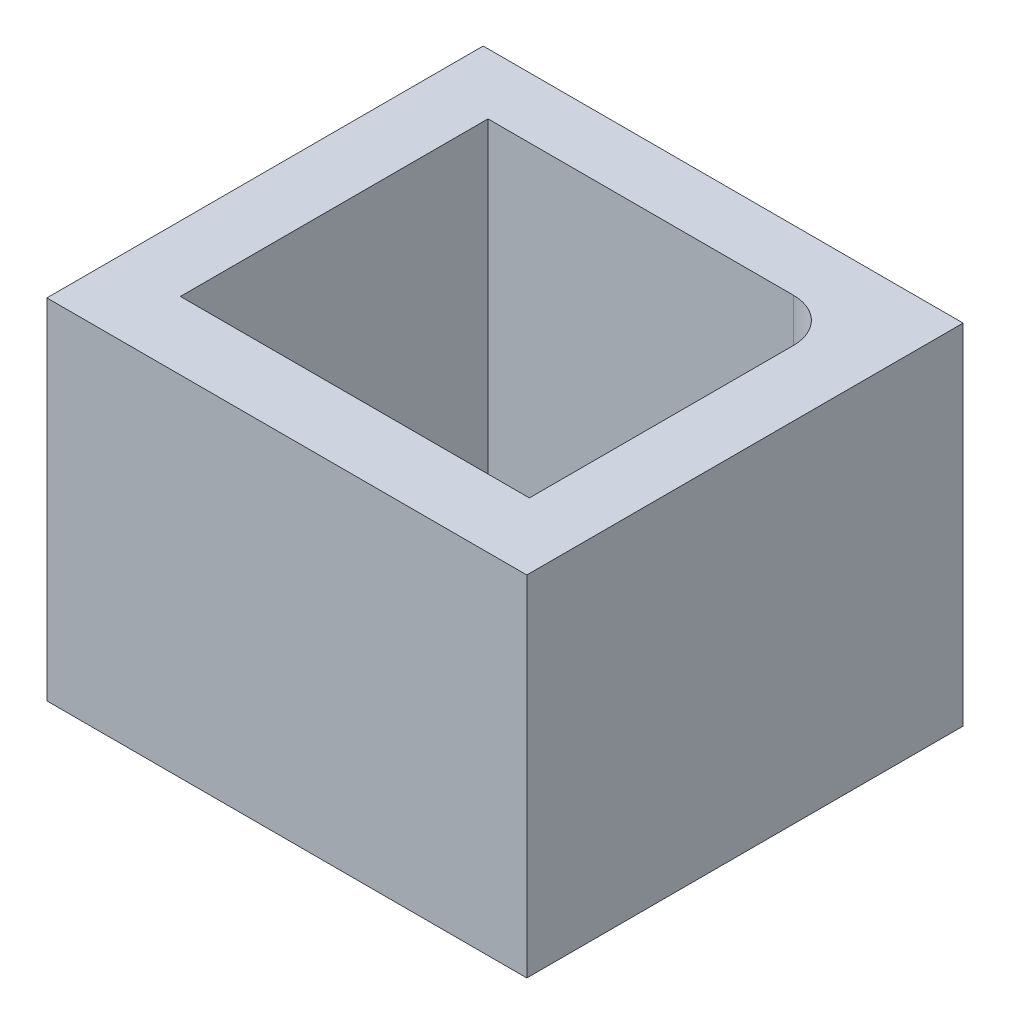
ISO-10303-21;
HEADER;
FILE_DESCRIPTION(('STEP AP214'),'2;1');
FILE_NAME('part.step','',(''),(''),'','','');
FILE_SCHEMA(('AUTOMOTIVE_DESIGN { 1 0 10303 214 1 1 1 1 }'));
ENDSEC;
DATA;
#1=APPLICATION_CONTEXT('core data for automotive mechanical design processes');
#2=APPLICATION_PROTOCOL_DEFINITION('international standard','automotive_design',2000,#1);
#3=PRODUCT_CONTEXT('',#1,'mechanical');
#4=PRODUCT('Part','Part','',(#3));
#5=PRODUCT_RELATED_PRODUCT_CATEGORY('part','',(#4));
#6=PRODUCT_DEFINITION_FORMATION('','',#4);
#7=PRODUCT_DEFINITION_CONTEXT('part definition',#1,'design');
#8=PRODUCT_DEFINITION('design','',#6,#7);
#9=PRODUCT_DEFINITION_SHAPE('','',#8);
#10=(LENGTH_UNIT() NAMED_UNIT(*) SI_UNIT(.MILLI.,.METRE.));
#11=(NAMED_UNIT(*) PLANE_ANGLE_UNIT() SI_UNIT($,.RADIAN.));
#12=(NAMED_UNIT(*) SI_UNIT($,.STERADIAN.) SOLID_ANGLE_UNIT());
#13=UNCERTAINTY_MEASURE_WITH_UNIT(LENGTH_MEASURE(1.E-05),#10,'distance_accuracy_value','');
#14=(GEOMETRIC_REPRESENTATION_CONTEXT(3) GLOBAL_UNCERTAINTY_ASSIGNED_CONTEXT((#13)) GLOBAL_UNIT_ASSIGNED_CONTEXT((#10,
#11,#12)) REPRESENTATION_CONTEXT('',''));
#15=CARTESIAN_POINT('',(0.,0.,0.));
#16=DIRECTION('',(0.,0.,1.));
#17=DIRECTION('',(1.,0.,0.));
#18=AXIS2_PLACEMENT_3D('',#15,#16,#17);
#19=CARTESIAN_POINT('',(0.,30.,0.));
#20=DIRECTION('',(0.,-1.,0.));
#21=DIRECTION('',(0.,0.,-1.));
#22=AXIS2_PLACEMENT_3D('',#19,#20,#21);
#23=PLANE('',#22);
#24=CARTESIAN_POINT('',(15.,30.,-15.));
#25=DIRECTION('',(0.,1.,0.));
#26=DIRECTION('',(0.,0.,1.));
#27=AXIS2_PLACEMENT_3D('',#24,#25,#26);
#28=CIRCLE('',#27,5.);
#29=CARTESIAN_POINT('',(20.,30.,-15.));
#30=VERTEX_POINT('',#29);
#31=CARTESIAN_POINT('',(15.,30.,-20.));
#32=VERTEX_POINT('',#31);
#33=EDGE_CURVE('E75',#30,#32,#28,.T.);
#34=ORIENTED_EDGE('',*,*,#33,.T.);
#35=DIRECTION('',(-1.,0.,0.));
#36=VECTOR('',#35,1.);
#37=CARTESIAN_POINT('',(15.,30.,-20.));
#38=LINE('',#37,#36);
#39=CARTESIAN_POINT('',(-19.9936005393496,30.,-20.));
#40=VERTEX_POINT('',#39);
#41=EDGE_CURVE('E186',#32,#40,#38,.T.);
#42=ORIENTED_EDGE('',*,*,#41,.T.);
#43=DIRECTION('',(0.,0.,1.));
#44=VECTOR('',#43,1.);
#45=CARTESIAN_POINT('',(-19.9936005393496,30.,-20.));
#46=LINE('',#45,#44);
#47=CARTESIAN_POINT('',(-19.9936005393496,30.,15.25));
#48=VERTEX_POINT('',#47);
#49=EDGE_CURVE('E190',#40,#48,#46,.T.);
#50=ORIENTED_EDGE('',*,*,#49,.T.);
#51=DIRECTION('',(1.,0.,0.));
#52=VECTOR('',#51,1.);
#53=CARTESIAN_POINT('',(-19.9936005393496,30.,15.25));
#54=LINE('',#53,#52);
#55=CARTESIAN_POINT('',(20.,30.,15.25));
#56=VERTEX_POINT('',#55);
#57=EDGE_CURVE('E194',#48,#56,#54,.T.);
#58=ORIENTED_EDGE('',*,*,#57,.T.);
#59=DIRECTION('',(0.,0.,-1.));
#60=VECTOR('',#59,1.);
#61=CARTESIAN_POINT('',(20.,30.,15.25));
#62=LINE('',#61,#60);
#63=EDGE_CURVE('E142',#56,#30,#62,.T.);
#64=ORIENTED_EDGE('',*,*,#63,.T.);
#65=EDGE_LOOP('',(#34,#42,#50,#58,#64));
#66=FACE_BOUND('',#65,.T.);
#67=DIRECTION('',(1.,0.,0.));
#68=VECTOR('',#67,1.);
#69=CARTESIAN_POINT('',(-27.5,30.,23.0435212218331));
#70=LINE('',#69,#68);
#71=CARTESIAN_POINT('',(-27.5,30.,23.0435212218331));
#72=VERTEX_POINT('',#71);
#73=CARTESIAN_POINT('',(27.5,30.,23.0435212218331));
#74=VERTEX_POINT('',#73);
#75=EDGE_CURVE('E83',#72,#74,#70,.T.);
#76=ORIENTED_EDGE('',*,*,#75,.F.);
#77=DIRECTION('',(0.,0.,1.));
#78=VECTOR('',#77,1.);
#79=CARTESIAN_POINT('',(-27.5,30.,23.0435212218331));
#80=LINE('',#79,#78);
#81=CARTESIAN_POINT('',(-27.5,30.,-26.9564787781669));
#82=VERTEX_POINT('',#81);
#83=EDGE_CURVE('E217',#82,#72,#80,.T.);
#84=ORIENTED_EDGE('',*,*,#83,.F.);
#85=DIRECTION('',(-1.,0.,0.));
#86=VECTOR('',#85,1.);
#87=CARTESIAN_POINT('',(-27.5,30.,-26.9564787781669));
#88=LINE('',#87,#86);
#89=CARTESIAN_POINT('',(27.5,30.,-26.9564787781669));
#90=VERTEX_POINT('',#89);
#91=EDGE_CURVE('E214',#90,#82,#88,.T.);
#92=ORIENTED_EDGE('',*,*,#91,.F.);
#93=DIRECTION('',(0.,0.,-1.));
#94=VECTOR('',#93,1.);
#95=CARTESIAN_POINT('',(27.5,30.,23.0435212218331));
#96=LINE('',#95,#94);
#97=EDGE_CURVE('E211',#74,#90,#96,.T.);
#98=ORIENTED_EDGE('',*,*,#97,.F.);
#99=EDGE_LOOP('',(#76,#84,#92,#98));
#100=FACE_BOUND('',#99,.T.);
#101=ADVANCED_FACE('F59',(#66,#100),#23,.T.);
#102=CARTESIAN_POINT('',(27.5,35.,23.0435212218331));
#103=DIRECTION('',(-1.,0.,0.));
#104=DIRECTION('',(0.,0.,1.));
#105=AXIS2_PLACEMENT_3D('',#102,#103,#104);
#106=PLANE('',#105);
#107=ORIENTED_EDGE('',*,*,#97,.T.);
#108=DIRECTION('',(0.,-1.,0.));
#109=VECTOR('',#108,1.);
#110=CARTESIAN_POINT('',(27.5,35.,-26.9564787781669));
#111=LINE('',#110,#109);
#112=CARTESIAN_POINT('',(27.5,70.,-26.9564787781669));
#113=VERTEX_POINT('',#112);
#114=EDGE_CURVE('E12',#113,#90,#111,.T.);
#115=ORIENTED_EDGE('',*,*,#114,.F.);
#116=DIRECTION('',(0.,0.,1.));
#117=VECTOR('',#116,1.);
#118=CARTESIAN_POINT('',(27.5,70.,23.0435212218331));
#119=LINE('',#118,#117);
#120=CARTESIAN_POINT('',(27.5,70.,23.0435212218331));
#121=VERTEX_POINT('',#120);
#122=EDGE_CURVE('E176',#113,#121,#119,.T.);
#123=ORIENTED_EDGE('',*,*,#122,.T.);
#124=DIRECTION('',(0.,-1.,0.));
#125=VECTOR('',#124,1.);
#126=CARTESIAN_POINT('',(27.5,35.,23.0435212218331));
#127=LINE('',#126,#125);
#128=EDGE_CURVE('E222',#121,#74,#127,.T.);
#129=ORIENTED_EDGE('',*,*,#128,.T.);
#130=EDGE_LOOP('',(#107,#115,#123,#129));
#131=FACE_BOUND('',#130,.T.);
#132=ADVANCED_FACE('F61',(#131),#106,.F.);
#133=CARTESIAN_POINT('',(-27.5,35.,-26.9564787781669));
#134=DIRECTION('',(0.,0.,1.));
#135=DIRECTION('',(1.,0.,0.));
#136=AXIS2_PLACEMENT_3D('',#133,#134,#135);
#137=PLANE('',#136);
#138=ORIENTED_EDGE('',*,*,#91,.T.);
#139=DIRECTION('',(0.,-1.,0.));
#140=VECTOR('',#139,1.);
#141=CARTESIAN_POINT('',(-27.5,35.,-26.9564787781669));
#142=LINE('',#141,#140);
#143=CARTESIAN_POINT('',(-27.5,70.,-26.9564787781669));
#144=VERTEX_POINT('',#143);
#145=EDGE_CURVE('E68',#144,#82,#142,.T.);
#146=ORIENTED_EDGE('',*,*,#145,.F.);
#147=DIRECTION('',(1.,0.,0.));
#148=VECTOR('',#147,1.);
#149=CARTESIAN_POINT('',(-27.5,70.,-26.9564787781669));
#150=LINE('',#149,#148);
#151=EDGE_CURVE('E172',#144,#113,#150,.T.);
#152=ORIENTED_EDGE('',*,*,#151,.T.);
#153=ORIENTED_EDGE('',*,*,#114,.T.);
#154=EDGE_LOOP('',(#138,#146,#152,#153));
#155=FACE_BOUND('',#154,.T.);
#156=ADVANCED_FACE('F242',(#155),#137,.F.);
#157=CARTESIAN_POINT('',(-27.5,35.,23.0435212218331));
#158=DIRECTION('',(1.,0.,0.));
#159=DIRECTION('',(0.,0.,-1.));
#160=AXIS2_PLACEMENT_3D('',#157,#158,#159);
#161=PLANE('',#160);
#162=ORIENTED_EDGE('',*,*,#83,.T.);
#163=DIRECTION('',(0.,-1.,0.));
#164=VECTOR('',#163,1.);
#165=CARTESIAN_POINT('',(-27.5,35.,23.0435212218331));
#166=LINE('',#165,#164);
#167=CARTESIAN_POINT('',(-27.5,70.,23.0435212218331));
#168=VERTEX_POINT('',#167);
#169=EDGE_CURVE('E225',#168,#72,#166,.T.);
#170=ORIENTED_EDGE('',*,*,#169,.F.);
#171=DIRECTION('',(0.,0.,-1.));
#172=VECTOR('',#171,1.);
#173=CARTESIAN_POINT('',(-27.5,70.,23.0435212218331));
#174=LINE('',#173,#172);
#175=EDGE_CURVE('E168',#168,#144,#174,.T.);
#176=ORIENTED_EDGE('',*,*,#175,.T.);
#177=ORIENTED_EDGE('',*,*,#145,.T.);
#178=EDGE_LOOP('',(#162,#170,#176,#177));
#179=FACE_BOUND('',#178,.T.);
#180=ADVANCED_FACE('F231',(#179),#161,.F.);
#181=CARTESIAN_POINT('',(-27.5,35.,23.0435212218331));
#182=DIRECTION('',(0.,0.,-1.));
#183=DIRECTION('',(-1.,0.,0.));
#184=AXIS2_PLACEMENT_3D('',#181,#182,#183);
#185=PLANE('',#184);
#186=ORIENTED_EDGE('',*,*,#75,.T.);
#187=ORIENTED_EDGE('',*,*,#128,.F.);
#188=DIRECTION('',(-1.,0.,0.));
#189=VECTOR('',#188,1.);
#190=CARTESIAN_POINT('',(-27.5,70.,23.0435212218331));
#191=LINE('',#190,#189);
#192=EDGE_CURVE('E180',#121,#168,#191,.T.);
#193=ORIENTED_EDGE('',*,*,#192,.T.);
#194=ORIENTED_EDGE('',*,*,#169,.T.);
#195=EDGE_LOOP('',(#186,#187,#193,#194));
#196=FACE_BOUND('',#195,.T.);
#197=ADVANCED_FACE('F241',(#196),#185,.F.);
#198=CARTESIAN_POINT('',(15.,35.,-15.));
#199=DIRECTION('',(0.,-1.,0.));
#200=DIRECTION('',(0.,0.,-1.));
#201=AXIS2_PLACEMENT_3D('',#198,#199,#200);
#202=CYLINDRICAL_SURFACE('',#201,5.);
#203=ORIENTED_EDGE('',*,*,#33,.F.);
#204=DIRECTION('',(0.,-1.,0.));
#205=VECTOR('',#204,1.);
#206=CARTESIAN_POINT('',(20.,35.,-15.));
#207=LINE('',#206,#205);
#208=CARTESIAN_POINT('',(20.,70.,-15.));
#209=VERTEX_POINT('',#208);
#210=EDGE_CURVE('E131',#209,#30,#207,.T.);
#211=ORIENTED_EDGE('',*,*,#210,.F.);
#212=CARTESIAN_POINT('',(15.,70.,-15.));
#213=DIRECTION('',(0.,-1.,0.));
#214=DIRECTION('',(0.,0.,-1.));
#215=AXIS2_PLACEMENT_3D('',#212,#213,#214);
#216=CIRCLE('',#215,5.);
#217=CARTESIAN_POINT('',(15.,70.,-20.));
#218=VERTEX_POINT('',#217);
#219=EDGE_CURVE('E135',#218,#209,#216,.T.);
#220=ORIENTED_EDGE('',*,*,#219,.F.);
#221=DIRECTION('',(0.,-1.,0.));
#222=VECTOR('',#221,1.);
#223=CARTESIAN_POINT('',(15.,35.,-20.));
#224=LINE('',#223,#222);
#225=EDGE_CURVE('E208',#218,#32,#224,.T.);
#226=ORIENTED_EDGE('',*,*,#225,.T.);
#227=EDGE_LOOP('',(#203,#211,#220,#226));
#228=FACE_BOUND('',#227,.T.);
#229=ADVANCED_FACE('F133',(#228),#202,.F.);
#230=CARTESIAN_POINT('',(15.,35.,-20.));
#231=DIRECTION('',(0.,0.,1.));
#232=DIRECTION('',(1.,0.,0.));
#233=AXIS2_PLACEMENT_3D('',#230,#231,#232);
#234=PLANE('',#233);
#235=ORIENTED_EDGE('',*,*,#41,.F.);
#236=ORIENTED_EDGE('',*,*,#225,.F.);
#237=DIRECTION('',(1.,0.,0.));
#238=VECTOR('',#237,1.);
#239=CARTESIAN_POINT('',(-19.9936005393496,70.,-20.));
#240=LINE('',#239,#238);
#241=CARTESIAN_POINT('',(-19.9936005393496,70.,-20.));
#242=VERTEX_POINT('',#241);
#243=EDGE_CURVE('E157',#242,#218,#240,.T.);
#244=ORIENTED_EDGE('',*,*,#243,.F.);
#245=DIRECTION('',(0.,-1.,0.));
#246=VECTOR('',#245,1.);
#247=CARTESIAN_POINT('',(-19.9936005393496,35.,-20.));
#248=LINE('',#247,#246);
#249=EDGE_CURVE('E205',#242,#40,#248,.T.);
#250=ORIENTED_EDGE('',*,*,#249,.T.);
#251=EDGE_LOOP('',(#235,#236,#244,#250));
#252=FACE_BOUND('',#251,.T.);
#253=ADVANCED_FACE('F261',(#252),#234,.T.);
#254=CARTESIAN_POINT('',(-19.9936005393496,35.,-20.));
#255=DIRECTION('',(1.,0.,0.));
#256=DIRECTION('',(0.,0.,-1.));
#257=AXIS2_PLACEMENT_3D('',#254,#255,#256);
#258=PLANE('',#257);
#259=ORIENTED_EDGE('',*,*,#49,.F.);
#260=ORIENTED_EDGE('',*,*,#249,.F.);
#261=DIRECTION('',(0.,0.,-1.));
#262=VECTOR('',#261,1.);
#263=CARTESIAN_POINT('',(-19.9936005393496,70.,15.25));
#264=LINE('',#263,#262);
#265=CARTESIAN_POINT('',(-19.9936005393496,70.,15.25));
#266=VERTEX_POINT('',#265);
#267=EDGE_CURVE('E163',#266,#242,#264,.T.);
#268=ORIENTED_EDGE('',*,*,#267,.F.);
#269=DIRECTION('',(0.,-1.,0.));
#270=VECTOR('',#269,1.);
#271=CARTESIAN_POINT('',(-19.9936005393496,35.,15.25));
#272=LINE('',#271,#270);
#273=EDGE_CURVE('E202',#266,#48,#272,.T.);
#274=ORIENTED_EDGE('',*,*,#273,.T.);
#275=EDGE_LOOP('',(#259,#260,#268,#274));
#276=FACE_BOUND('',#275,.T.);
#277=ADVANCED_FACE('F265',(#276),#258,.T.);
#278=CARTESIAN_POINT('',(-19.9936005393496,35.,15.25));
#279=DIRECTION('',(0.,0.,-1.));
#280=DIRECTION('',(-1.,0.,0.));
#281=AXIS2_PLACEMENT_3D('',#278,#279,#280);
#282=PLANE('',#281);
#283=ORIENTED_EDGE('',*,*,#57,.F.);
#284=ORIENTED_EDGE('',*,*,#273,.F.);
#285=DIRECTION('',(-1.,0.,0.));
#286=VECTOR('',#285,1.);
#287=CARTESIAN_POINT('',(20.,70.,15.25));
#288=LINE('',#287,#286);
#289=CARTESIAN_POINT('',(20.,70.,15.25));
#290=VERTEX_POINT('',#289);
#291=EDGE_CURVE('E151',#290,#266,#288,.T.);
#292=ORIENTED_EDGE('',*,*,#291,.F.);
#293=DIRECTION('',(0.,-1.,0.));
#294=VECTOR('',#293,1.);
#295=CARTESIAN_POINT('',(20.,35.,15.25));
#296=LINE('',#295,#294);
#297=EDGE_CURVE('E141',#290,#56,#296,.T.);
#298=ORIENTED_EDGE('',*,*,#297,.T.);
#299=EDGE_LOOP('',(#283,#284,#292,#298));
#300=FACE_BOUND('',#299,.T.);
#301=ADVANCED_FACE('F270',(#300),#282,.T.);
#302=CARTESIAN_POINT('',(20.,35.,15.25));
#303=DIRECTION('',(-1.,0.,0.));
#304=DIRECTION('',(0.,0.,1.));
#305=AXIS2_PLACEMENT_3D('',#302,#303,#304);
#306=PLANE('',#305);
#307=ORIENTED_EDGE('',*,*,#63,.F.);
#308=ORIENTED_EDGE('',*,*,#297,.F.);
#309=DIRECTION('',(0.,0.,1.));
#310=VECTOR('',#309,1.);
#311=CARTESIAN_POINT('',(20.,70.,-15.));
#312=LINE('',#311,#310);
#313=EDGE_CURVE('E145',#209,#290,#312,.T.);
#314=ORIENTED_EDGE('',*,*,#313,.F.);
#315=ORIENTED_EDGE('',*,*,#210,.T.);
#316=EDGE_LOOP('',(#307,#308,#314,#315));
#317=FACE_BOUND('',#316,.T.);
#318=ADVANCED_FACE('F146',(#317),#306,.T.);
#319=CARTESIAN_POINT('',(0.,70.,0.));
#320=DIRECTION('',(0.,-1.,0.));
#321=DIRECTION('',(0.,0.,-1.));
#322=AXIS2_PLACEMENT_3D('',#319,#320,#321);
#323=PLANE('',#322);
#324=ORIENTED_EDGE('',*,*,#243,.T.);
#325=ORIENTED_EDGE('',*,*,#219,.T.);
#326=ORIENTED_EDGE('',*,*,#313,.T.);
#327=ORIENTED_EDGE('',*,*,#291,.T.);
#328=ORIENTED_EDGE('',*,*,#267,.T.);
#329=EDGE_LOOP('',(#324,#325,#326,#327,#328));
#330=FACE_BOUND('',#329,.T.);
#331=ORIENTED_EDGE('',*,*,#175,.F.);
#332=ORIENTED_EDGE('',*,*,#192,.F.);
#333=ORIENTED_EDGE('',*,*,#122,.F.);
#334=ORIENTED_EDGE('',*,*,#151,.F.);
#335=EDGE_LOOP('',(#331,#332,#333,#334));
#336=FACE_BOUND('',#335,.T.);
#337=ADVANCED_FACE('F153',(#330,#336),#323,.F.);
#338=CLOSED_SHELL('',(#101,#132,#156,#180,#197,#229,#253,#277,#301,#318,#337));
#339=MANIFOLD_SOLID_BREP('B2',#338);
#340=ADVANCED_BREP_SHAPE_REPRESENTATION('',(#18,#339),#14);
#341=SHAPE_DEFINITION_REPRESENTATION(#9,#340);
ENDSEC;
END-ISO-10303-21;
